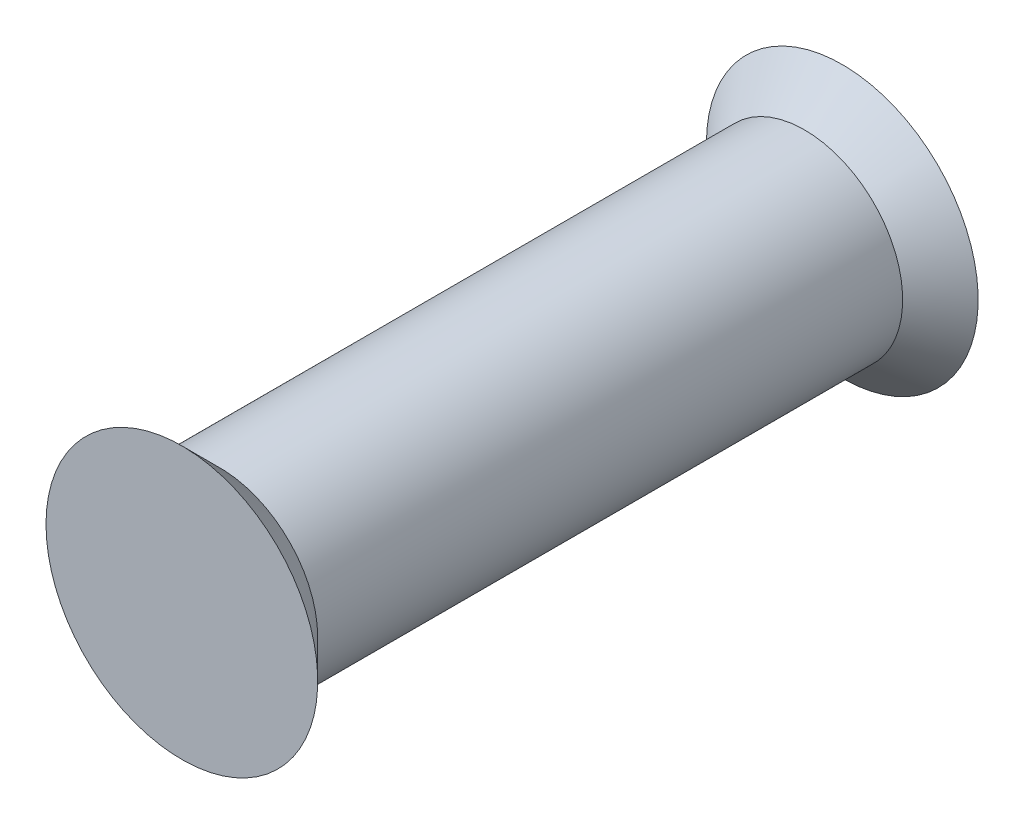
ISO-10303-21;
HEADER;
FILE_DESCRIPTION(('STEP AP214'),'2;1');
FILE_NAME('part.step','',(''),(''),'','','');
FILE_SCHEMA(('AUTOMOTIVE_DESIGN { 1 0 10303 214 1 1 1 1 }'));
ENDSEC;
DATA;
#1=APPLICATION_CONTEXT('core data for automotive mechanical design processes');
#2=APPLICATION_PROTOCOL_DEFINITION('international standard','automotive_design',2000,#1);
#3=PRODUCT_CONTEXT('',#1,'mechanical');
#4=PRODUCT('Part','Part','',(#3));
#5=PRODUCT_RELATED_PRODUCT_CATEGORY('part','',(#4));
#6=PRODUCT_DEFINITION_FORMATION('','',#4);
#7=PRODUCT_DEFINITION_CONTEXT('part definition',#1,'design');
#8=PRODUCT_DEFINITION('design','',#6,#7);
#9=PRODUCT_DEFINITION_SHAPE('','',#8);
#10=(LENGTH_UNIT() NAMED_UNIT(*) SI_UNIT(.MILLI.,.METRE.));
#11=(NAMED_UNIT(*) PLANE_ANGLE_UNIT() SI_UNIT($,.RADIAN.));
#12=(NAMED_UNIT(*) SI_UNIT($,.STERADIAN.) SOLID_ANGLE_UNIT());
#13=UNCERTAINTY_MEASURE_WITH_UNIT(LENGTH_MEASURE(1.E-05),#10,'distance_accuracy_value','');
#14=(GEOMETRIC_REPRESENTATION_CONTEXT(3) GLOBAL_UNCERTAINTY_ASSIGNED_CONTEXT((#13)) GLOBAL_UNIT_ASSIGNED_CONTEXT((#10,
#11,#12)) REPRESENTATION_CONTEXT('',''));
#15=CARTESIAN_POINT('',(0.,0.,0.));
#16=DIRECTION('',(0.,0.,1.));
#17=DIRECTION('',(1.,0.,0.));
#18=AXIS2_PLACEMENT_3D('',#15,#16,#17);
#19=CARTESIAN_POINT('',(0.,0.,-13.6595211074172));
#20=DIRECTION('',(0.,0.,-1.));
#21=DIRECTION('',(-1.,0.,0.));
#22=AXIS2_PLACEMENT_3D('',#19,#20,#21);
#23=CYLINDRICAL_SURFACE('',#22,2.6);
#24=CARTESIAN_POINT('',(0.,0.,-7.75));
#25=DIRECTION('',(0.,0.,-1.));
#26=DIRECTION('',(-1.,0.,0.));
#27=AXIS2_PLACEMENT_3D('',#24,#25,#26);
#28=CIRCLE('',#27,2.6);
#29=CARTESIAN_POINT('',(-2.6,0.,-7.75));
#30=VERTEX_POINT('',#29);
#31=EDGE_CURVE('E10',#30,#30,#28,.T.);
#32=ORIENTED_EDGE('',*,*,#31,.F.);
#33=EDGE_LOOP('',(#32));
#34=FACE_BOUND('',#33,.T.);
#35=CARTESIAN_POINT('',(0.,0.,7.75));
#36=DIRECTION('',(0.,0.,1.));
#37=DIRECTION('',(1.,0.,0.));
#38=AXIS2_PLACEMENT_3D('',#35,#36,#37);
#39=CIRCLE('',#38,2.6);
#40=CARTESIAN_POINT('',(2.6,0.,7.75));
#41=VERTEX_POINT('',#40);
#42=EDGE_CURVE('E37',#41,#41,#39,.T.);
#43=ORIENTED_EDGE('',*,*,#42,.F.);
#44=EDGE_LOOP('',(#43));
#45=FACE_BOUND('',#44,.T.);
#46=ADVANCED_FACE('F30',(#34,#45),#23,.T.);
#47=CARTESIAN_POINT('',(0.,0.,7.75));
#48=DIRECTION('',(0.,0.,1.));
#49=DIRECTION('',(1.,0.,0.));
#50=AXIS2_PLACEMENT_3D('',#47,#48,#49);
#51=CONICAL_SURFACE('',#50,2.6,0.785398163397448);
#52=CARTESIAN_POINT('',(0.,0.,8.75));
#53=DIRECTION('',(0.,0.,-1.));
#54=DIRECTION('',(-1.,0.,0.));
#55=AXIS2_PLACEMENT_3D('',#52,#53,#54);
#56=CIRCLE('',#55,3.6);
#57=CARTESIAN_POINT('',(-3.6,0.,8.75));
#58=VERTEX_POINT('',#57);
#59=EDGE_CURVE('E41',#58,#58,#56,.T.);
#60=ORIENTED_EDGE('',*,*,#59,.T.);
#61=EDGE_LOOP('',(#60));
#62=FACE_BOUND('',#61,.T.);
#63=ORIENTED_EDGE('',*,*,#42,.T.);
#64=EDGE_LOOP('',(#63));
#65=FACE_BOUND('',#64,.T.);
#66=ADVANCED_FACE('F60',(#62,#65),#51,.T.);
#67=CARTESIAN_POINT('',(-2.6,0.,8.75));
#68=DIRECTION('',(0.,0.,1.));
#69=DIRECTION('',(1.,0.,0.));
#70=AXIS2_PLACEMENT_3D('',#67,#68,#69);
#71=PLANE('',#70);
#72=ORIENTED_EDGE('',*,*,#59,.F.);
#73=EDGE_LOOP('',(#72));
#74=FACE_BOUND('',#73,.T.);
#75=ADVANCED_FACE('F54',(#74),#71,.T.);
#76=CARTESIAN_POINT('',(0.,0.,-7.75));
#77=DIRECTION('',(0.,0.,-1.));
#78=DIRECTION('',(1.,0.,0.));
#79=AXIS2_PLACEMENT_3D('',#76,#77,#78);
#80=CONICAL_SURFACE('',#79,2.6,0.785398163397448);
#81=CARTESIAN_POINT('',(0.,0.,-8.75));
#82=DIRECTION('',(0.,0.,-1.));
#83=DIRECTION('',(-1.,0.,0.));
#84=AXIS2_PLACEMENT_3D('',#81,#82,#83);
#85=CIRCLE('',#84,3.6);
#86=CARTESIAN_POINT('',(-3.6,0.,-8.75));
#87=VERTEX_POINT('',#86);
#88=EDGE_CURVE('E45',#87,#87,#85,.T.);
#89=ORIENTED_EDGE('',*,*,#88,.F.);
#90=EDGE_LOOP('',(#89));
#91=FACE_BOUND('',#90,.T.);
#92=ORIENTED_EDGE('',*,*,#31,.T.);
#93=EDGE_LOOP('',(#92));
#94=FACE_BOUND('',#93,.T.);
#95=ADVANCED_FACE('F52',(#91,#94),#80,.T.);
#96=CARTESIAN_POINT('',(0.,0.,-8.75));
#97=DIRECTION('',(0.,0.,-1.));
#98=DIRECTION('',(-1.,0.,0.));
#99=AXIS2_PLACEMENT_3D('',#96,#97,#98);
#100=PLANE('',#99);
#101=ORIENTED_EDGE('',*,*,#88,.T.);
#102=EDGE_LOOP('',(#101));
#103=FACE_BOUND('',#102,.T.);
#104=ADVANCED_FACE('F32',(#103),#100,.T.);
#105=CLOSED_SHELL('',(#46,#66,#75,#95,#104));
#106=MANIFOLD_SOLID_BREP('B2',#105);
#107=ADVANCED_BREP_SHAPE_REPRESENTATION('',(#18,#106),#14);
#108=SHAPE_DEFINITION_REPRESENTATION(#9,#107);
ENDSEC;
END-ISO-10303-21;
